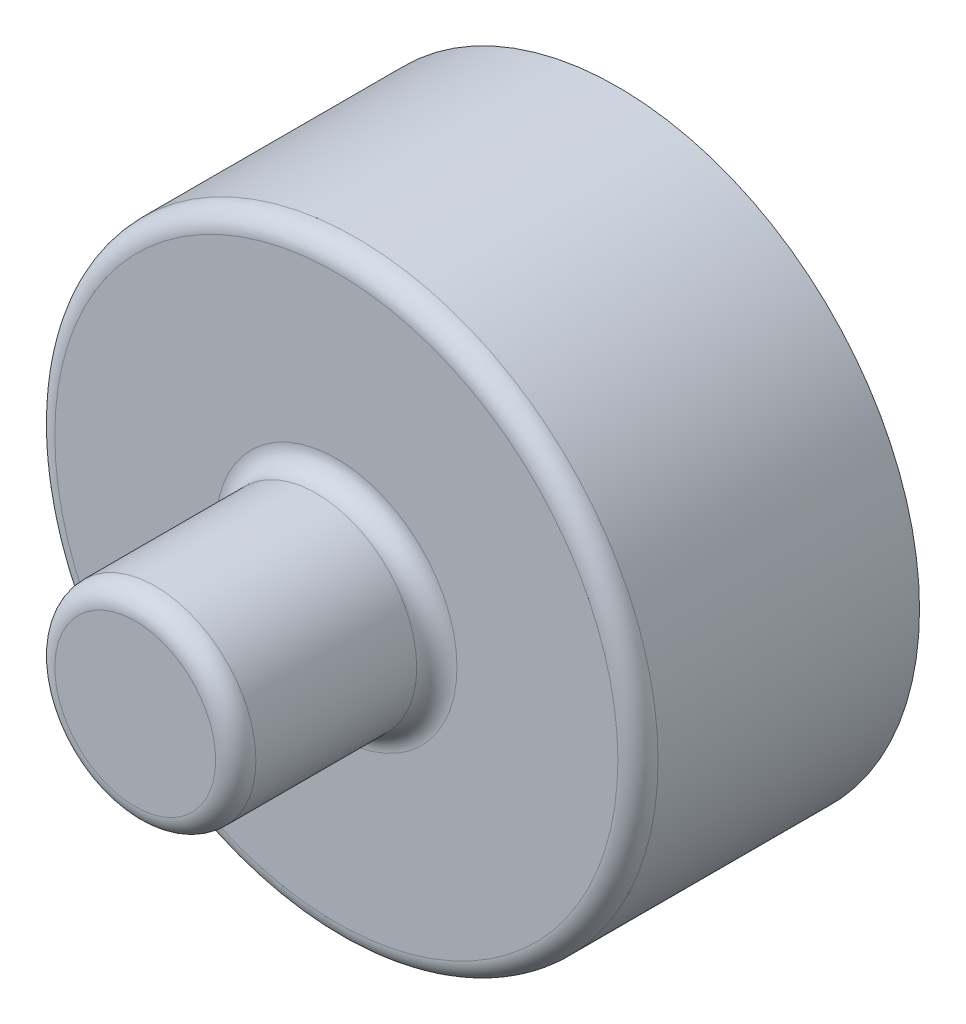
ISO-10303-21;
HEADER;
FILE_DESCRIPTION(('STEP AP214'),'2;1');
FILE_NAME('part.step','',(''),(''),'','','');
FILE_SCHEMA(('AUTOMOTIVE_DESIGN { 1 0 10303 214 1 1 1 1 }'));
ENDSEC;
DATA;
#1=APPLICATION_CONTEXT('core data for automotive mechanical design processes');
#2=APPLICATION_PROTOCOL_DEFINITION('international standard','automotive_design',2000,#1);
#3=PRODUCT_CONTEXT('',#1,'mechanical');
#4=PRODUCT('Part','Part','',(#3));
#5=PRODUCT_RELATED_PRODUCT_CATEGORY('part','',(#4));
#6=PRODUCT_DEFINITION_FORMATION('','',#4);
#7=PRODUCT_DEFINITION_CONTEXT('part definition',#1,'design');
#8=PRODUCT_DEFINITION('design','',#6,#7);
#9=PRODUCT_DEFINITION_SHAPE('','',#8);
#10=(LENGTH_UNIT() NAMED_UNIT(*) SI_UNIT(.MILLI.,.METRE.));
#11=(NAMED_UNIT(*) PLANE_ANGLE_UNIT() SI_UNIT($,.RADIAN.));
#12=(NAMED_UNIT(*) SI_UNIT($,.STERADIAN.) SOLID_ANGLE_UNIT());
#13=UNCERTAINTY_MEASURE_WITH_UNIT(LENGTH_MEASURE(1.E-05),#10,'distance_accuracy_value','');
#14=(GEOMETRIC_REPRESENTATION_CONTEXT(3) GLOBAL_UNCERTAINTY_ASSIGNED_CONTEXT((#13)) GLOBAL_UNIT_ASSIGNED_CONTEXT((#10,
#11,#12)) REPRESENTATION_CONTEXT('',''));
#15=CARTESIAN_POINT('',(0.,0.,0.));
#16=DIRECTION('',(0.,0.,1.));
#17=DIRECTION('',(1.,0.,0.));
#18=AXIS2_PLACEMENT_3D('',#15,#16,#17);
#19=CARTESIAN_POINT('',(0.,0.,7.));
#20=DIRECTION('',(0.,0.,-1.));
#21=DIRECTION('',(-1.,0.,0.));
#22=AXIS2_PLACEMENT_3D('',#19,#20,#21);
#23=CYLINDRICAL_SURFACE('',#22,7.5);
#24=CARTESIAN_POINT('',(0.,0.,6.5));
#25=DIRECTION('',(0.,0.,1.));
#26=DIRECTION('',(1.,0.,0.));
#27=AXIS2_PLACEMENT_3D('',#24,#25,#26);
#28=CIRCLE('',#27,7.5);
#29=CARTESIAN_POINT('',(7.5,0.,6.5));
#30=VERTEX_POINT('',#29);
#31=EDGE_CURVE('E38',#30,#30,#28,.F.);
#32=ORIENTED_EDGE('',*,*,#31,.T.);
#33=EDGE_LOOP('',(#32));
#34=FACE_BOUND('',#33,.T.);
#35=CARTESIAN_POINT('',(0.,0.,0.));
#36=DIRECTION('',(0.,0.,1.));
#37=DIRECTION('',(1.,0.,0.));
#38=AXIS2_PLACEMENT_3D('',#35,#36,#37);
#39=CIRCLE('',#38,7.5);
#40=CARTESIAN_POINT('',(7.5,0.,0.));
#41=VERTEX_POINT('',#40);
#42=EDGE_CURVE('E57',#41,#41,#39,.T.);
#43=ORIENTED_EDGE('',*,*,#42,.T.);
#44=EDGE_LOOP('',(#43));
#45=FACE_BOUND('',#44,.T.);
#46=ADVANCED_FACE('F31',(#34,#45),#23,.T.);
#47=CARTESIAN_POINT('',(0.,0.,7.));
#48=DIRECTION('',(0.,0.,1.));
#49=DIRECTION('',(1.,0.,0.));
#50=AXIS2_PLACEMENT_3D('',#47,#48,#49);
#51=PLANE('',#50);
#52=CARTESIAN_POINT('',(0.,0.,7.));
#53=DIRECTION('',(0.,0.,1.));
#54=DIRECTION('',(1.,0.,0.));
#55=AXIS2_PLACEMENT_3D('',#52,#53,#54);
#56=CIRCLE('',#55,3.);
#57=CARTESIAN_POINT('',(3.,0.,7.));
#58=VERTEX_POINT('',#57);
#59=EDGE_CURVE('E42',#58,#58,#56,.F.);
#60=ORIENTED_EDGE('',*,*,#59,.T.);
#61=EDGE_LOOP('',(#60));
#62=FACE_BOUND('',#61,.T.);
#63=CARTESIAN_POINT('',(0.,0.,7.));
#64=DIRECTION('',(0.,0.,1.));
#65=DIRECTION('',(1.,0.,0.));
#66=AXIS2_PLACEMENT_3D('',#63,#64,#65);
#67=CIRCLE('',#66,7.);
#68=CARTESIAN_POINT('',(7.,0.,7.));
#69=VERTEX_POINT('',#68);
#70=EDGE_CURVE('E46',#69,#69,#67,.T.);
#71=ORIENTED_EDGE('',*,*,#70,.T.);
#72=EDGE_LOOP('',(#71));
#73=FACE_BOUND('',#72,.T.);
#74=ADVANCED_FACE('F65',(#62,#73),#51,.T.);
#75=CARTESIAN_POINT('',(0.,0.,0.));
#76=DIRECTION('',(0.,0.,1.));
#77=DIRECTION('',(1.,0.,0.));
#78=AXIS2_PLACEMENT_3D('',#75,#76,#77);
#79=PLANE('',#78);
#80=ORIENTED_EDGE('',*,*,#42,.F.);
#81=EDGE_LOOP('',(#80));
#82=FACE_BOUND('',#81,.T.);
#83=ADVANCED_FACE('F62',(#82),#79,.F.);
#84=CARTESIAN_POINT('',(0.,0.,12.));
#85=DIRECTION('',(0.,0.,-1.));
#86=DIRECTION('',(-1.,0.,0.));
#87=AXIS2_PLACEMENT_3D('',#84,#85,#86);
#88=CYLINDRICAL_SURFACE('',#87,2.5);
#89=CARTESIAN_POINT('',(0.,0.,7.5));
#90=DIRECTION('',(0.,0.,1.));
#91=DIRECTION('',(1.,0.,0.));
#92=AXIS2_PLACEMENT_3D('',#89,#90,#91);
#93=CIRCLE('',#92,2.5);
#94=CARTESIAN_POINT('',(2.5,0.,7.5));
#95=VERTEX_POINT('',#94);
#96=EDGE_CURVE('E51',#95,#95,#93,.T.);
#97=ORIENTED_EDGE('',*,*,#96,.T.);
#98=EDGE_LOOP('',(#97));
#99=FACE_BOUND('',#98,.T.);
#100=CARTESIAN_POINT('',(0.,0.,11.5));
#101=DIRECTION('',(0.,0.,1.));
#102=DIRECTION('',(1.,0.,0.));
#103=AXIS2_PLACEMENT_3D('',#100,#101,#102);
#104=CIRCLE('',#103,2.5);
#105=CARTESIAN_POINT('',(2.5,0.,11.5));
#106=VERTEX_POINT('',#105);
#107=EDGE_CURVE('E54',#106,#106,#104,.F.);
#108=ORIENTED_EDGE('',*,*,#107,.T.);
#109=EDGE_LOOP('',(#108));
#110=FACE_BOUND('',#109,.T.);
#111=ADVANCED_FACE('F64',(#99,#110),#88,.T.);
#112=CARTESIAN_POINT('',(0.,0.,12.));
#113=DIRECTION('',(0.,0.,1.));
#114=DIRECTION('',(1.,0.,0.));
#115=AXIS2_PLACEMENT_3D('',#112,#113,#114);
#116=PLANE('',#115);
#117=CARTESIAN_POINT('',(0.,0.,12.));
#118=DIRECTION('',(0.,0.,1.));
#119=DIRECTION('',(1.,0.,0.));
#120=AXIS2_PLACEMENT_3D('',#117,#118,#119);
#121=CIRCLE('',#120,2.);
#122=CARTESIAN_POINT('',(2.,0.,12.));
#123=VERTEX_POINT('',#122);
#124=EDGE_CURVE('E10',#123,#123,#121,.T.);
#125=ORIENTED_EDGE('',*,*,#124,.T.);
#126=EDGE_LOOP('',(#125));
#127=FACE_BOUND('',#126,.T.);
#128=ADVANCED_FACE('F71',(#127),#116,.T.);
#129=CARTESIAN_POINT('',(0.,0.,7.5));
#130=DIRECTION('',(0.,0.,1.));
#131=DIRECTION('',(1.,0.,0.));
#132=AXIS2_PLACEMENT_3D('',#129,#130,#131);
#133=TOROIDAL_SURFACE('',#132,3.,0.5);
#134=ORIENTED_EDGE('',*,*,#59,.F.);
#135=EDGE_LOOP('',(#134));
#136=FACE_BOUND('',#135,.T.);
#137=ORIENTED_EDGE('',*,*,#96,.F.);
#138=EDGE_LOOP('',(#137));
#139=FACE_BOUND('',#138,.T.);
#140=ADVANCED_FACE('F81',(#136,#139),#133,.F.);
#141=CARTESIAN_POINT('',(0.,0.,6.5));
#142=DIRECTION('',(0.,0.,1.));
#143=DIRECTION('',(1.,0.,0.));
#144=AXIS2_PLACEMENT_3D('',#141,#142,#143);
#145=TOROIDAL_SURFACE('',#144,7.,0.5);
#146=ORIENTED_EDGE('',*,*,#31,.F.);
#147=EDGE_LOOP('',(#146));
#148=FACE_BOUND('',#147,.T.);
#149=ORIENTED_EDGE('',*,*,#70,.F.);
#150=EDGE_LOOP('',(#149));
#151=FACE_BOUND('',#150,.T.);
#152=ADVANCED_FACE('F83',(#148,#151),#145,.T.);
#153=CARTESIAN_POINT('',(0.,0.,11.5));
#154=DIRECTION('',(0.,0.,1.));
#155=DIRECTION('',(1.,0.,0.));
#156=AXIS2_PLACEMENT_3D('',#153,#154,#155);
#157=TOROIDAL_SURFACE('',#156,2.,0.5);
#158=ORIENTED_EDGE('',*,*,#107,.F.);
#159=EDGE_LOOP('',(#158));
#160=FACE_BOUND('',#159,.T.);
#161=ORIENTED_EDGE('',*,*,#124,.F.);
#162=EDGE_LOOP('',(#161));
#163=FACE_BOUND('',#162,.T.);
#164=ADVANCED_FACE('F33',(#160,#163),#157,.T.);
#165=CLOSED_SHELL('',(#46,#74,#83,#111,#128,#140,#152,#164));
#166=MANIFOLD_SOLID_BREP('B2',#165);
#167=ADVANCED_BREP_SHAPE_REPRESENTATION('',(#18,#166),#14);
#168=SHAPE_DEFINITION_REPRESENTATION(#9,#167);
ENDSEC;
END-ISO-10303-21;
